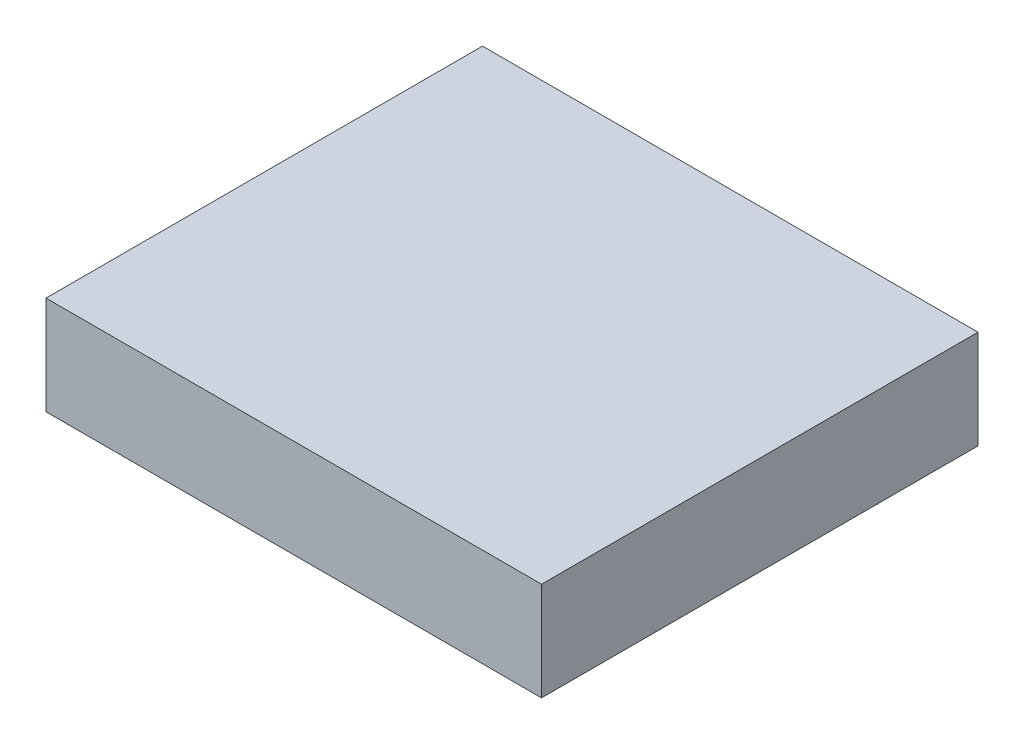
ISO-10303-21;
HEADER;
FILE_DESCRIPTION(('STEP AP214'),'2;1');
FILE_NAME('part.step','',(''),(''),'','','');
FILE_SCHEMA(('AUTOMOTIVE_DESIGN { 1 0 10303 214 1 1 1 1 }'));
ENDSEC;
DATA;
#1=APPLICATION_CONTEXT('core data for automotive mechanical design processes');
#2=APPLICATION_PROTOCOL_DEFINITION('international standard','automotive_design',2000,#1);
#3=PRODUCT_CONTEXT('',#1,'mechanical');
#4=PRODUCT('Part','Part','',(#3));
#5=PRODUCT_RELATED_PRODUCT_CATEGORY('part','',(#4));
#6=PRODUCT_DEFINITION_FORMATION('','',#4);
#7=PRODUCT_DEFINITION_CONTEXT('part definition',#1,'design');
#8=PRODUCT_DEFINITION('design','',#6,#7);
#9=PRODUCT_DEFINITION_SHAPE('','',#8);
#10=(LENGTH_UNIT() NAMED_UNIT(*) SI_UNIT(.MILLI.,.METRE.));
#11=(NAMED_UNIT(*) PLANE_ANGLE_UNIT() SI_UNIT($,.RADIAN.));
#12=(NAMED_UNIT(*) SI_UNIT($,.STERADIAN.) SOLID_ANGLE_UNIT());
#13=UNCERTAINTY_MEASURE_WITH_UNIT(LENGTH_MEASURE(1.E-05),#10,'distance_accuracy_value','');
#14=(GEOMETRIC_REPRESENTATION_CONTEXT(3) GLOBAL_UNCERTAINTY_ASSIGNED_CONTEXT((#13)) GLOBAL_UNIT_ASSIGNED_CONTEXT((#10,
#11,#12)) REPRESENTATION_CONTEXT('',''));
#15=CARTESIAN_POINT('',(0.,0.,0.));
#16=DIRECTION('',(0.,0.,1.));
#17=DIRECTION('',(1.,0.,0.));
#18=AXIS2_PLACEMENT_3D('',#15,#16,#17);
#19=CARTESIAN_POINT('',(0.,3.,0.));
#20=DIRECTION('',(1.,0.,0.));
#21=DIRECTION('',(0.,0.,-1.));
#22=AXIS2_PLACEMENT_3D('',#19,#20,#21);
#23=PLANE('',#22);
#24=DIRECTION('',(0.,0.,1.));
#25=VECTOR('',#24,1.);
#26=CARTESIAN_POINT('',(0.,0.,0.));
#27=LINE('',#26,#25);
#28=CARTESIAN_POINT('',(0.,0.,0.));
#29=VERTEX_POINT('',#28);
#30=CARTESIAN_POINT('',(0.,0.,13.3));
#31=VERTEX_POINT('',#30);
#32=EDGE_CURVE('E96',#29,#31,#27,.T.);
#33=ORIENTED_EDGE('',*,*,#32,.T.);
#34=DIRECTION('',(0.,-1.,0.));
#35=VECTOR('',#34,1.);
#36=CARTESIAN_POINT('',(0.,3.,13.3));
#37=LINE('',#36,#35);
#38=CARTESIAN_POINT('',(0.,3.,13.3));
#39=VERTEX_POINT('',#38);
#40=EDGE_CURVE('E11',#39,#31,#37,.T.);
#41=ORIENTED_EDGE('',*,*,#40,.F.);
#42=DIRECTION('',(0.,0.,1.));
#43=VECTOR('',#42,1.);
#44=CARTESIAN_POINT('',(0.,3.,0.));
#45=LINE('',#44,#43);
#46=CARTESIAN_POINT('',(0.,3.,0.));
#47=VERTEX_POINT('',#46);
#48=EDGE_CURVE('E84',#47,#39,#45,.T.);
#49=ORIENTED_EDGE('',*,*,#48,.F.);
#50=DIRECTION('',(0.,-1.,0.));
#51=VECTOR('',#50,1.);
#52=CARTESIAN_POINT('',(0.,3.,0.));
#53=LINE('',#52,#51);
#54=EDGE_CURVE('E92',#47,#29,#53,.T.);
#55=ORIENTED_EDGE('',*,*,#54,.T.);
#56=EDGE_LOOP('',(#33,#41,#49,#55));
#57=FACE_BOUND('',#56,.T.);
#58=ADVANCED_FACE('F33',(#57),#23,.F.);
#59=CARTESIAN_POINT('',(0.,3.,13.3));
#60=DIRECTION('',(0.,0.,-1.));
#61=DIRECTION('',(-1.,0.,0.));
#62=AXIS2_PLACEMENT_3D('',#59,#60,#61);
#63=PLANE('',#62);
#64=DIRECTION('',(1.,0.,0.));
#65=VECTOR('',#64,1.);
#66=CARTESIAN_POINT('',(0.,0.,13.3));
#67=LINE('',#66,#65);
#68=CARTESIAN_POINT('',(15.1,0.,13.3));
#69=VERTEX_POINT('',#68);
#70=EDGE_CURVE('E88',#31,#69,#67,.T.);
#71=ORIENTED_EDGE('',*,*,#70,.T.);
#72=DIRECTION('',(0.,-1.,0.));
#73=VECTOR('',#72,1.);
#74=CARTESIAN_POINT('',(15.1,3.,13.3));
#75=LINE('',#74,#73);
#76=CARTESIAN_POINT('',(15.1,3.,13.3));
#77=VERTEX_POINT('',#76);
#78=EDGE_CURVE('E41',#77,#69,#75,.T.);
#79=ORIENTED_EDGE('',*,*,#78,.F.);
#80=DIRECTION('',(1.,0.,0.));
#81=VECTOR('',#80,1.);
#82=CARTESIAN_POINT('',(0.,3.,13.3));
#83=LINE('',#82,#81);
#84=EDGE_CURVE('E79',#39,#77,#83,.T.);
#85=ORIENTED_EDGE('',*,*,#84,.F.);
#86=ORIENTED_EDGE('',*,*,#40,.T.);
#87=EDGE_LOOP('',(#71,#79,#85,#86));
#88=FACE_BOUND('',#87,.T.);
#89=ADVANCED_FACE('F87',(#88),#63,.F.);
#90=CARTESIAN_POINT('',(15.1,3.,0.));
#91=DIRECTION('',(-1.,0.,0.));
#92=DIRECTION('',(0.,0.,1.));
#93=AXIS2_PLACEMENT_3D('',#90,#91,#92);
#94=PLANE('',#93);
#95=DIRECTION('',(0.,0.,-1.));
#96=VECTOR('',#95,1.);
#97=CARTESIAN_POINT('',(15.1,0.,0.));
#98=LINE('',#97,#96);
#99=CARTESIAN_POINT('',(15.1,0.,0.));
#100=VERTEX_POINT('',#99);
#101=EDGE_CURVE('E66',#69,#100,#98,.T.);
#102=ORIENTED_EDGE('',*,*,#101,.T.);
#103=DIRECTION('',(0.,-1.,0.));
#104=VECTOR('',#103,1.);
#105=CARTESIAN_POINT('',(15.1,3.,0.));
#106=LINE('',#105,#104);
#107=CARTESIAN_POINT('',(15.1,3.,0.));
#108=VERTEX_POINT('',#107);
#109=EDGE_CURVE('E89',#108,#100,#106,.T.);
#110=ORIENTED_EDGE('',*,*,#109,.F.);
#111=DIRECTION('',(0.,0.,-1.));
#112=VECTOR('',#111,1.);
#113=CARTESIAN_POINT('',(15.1,3.,0.));
#114=LINE('',#113,#112);
#115=EDGE_CURVE('E82',#77,#108,#114,.T.);
#116=ORIENTED_EDGE('',*,*,#115,.F.);
#117=ORIENTED_EDGE('',*,*,#78,.T.);
#118=EDGE_LOOP('',(#102,#110,#116,#117));
#119=FACE_BOUND('',#118,.T.);
#120=ADVANCED_FACE('F90',(#119),#94,.F.);
#121=CARTESIAN_POINT('',(0.,3.,0.));
#122=DIRECTION('',(0.,0.,1.));
#123=DIRECTION('',(1.,0.,0.));
#124=AXIS2_PLACEMENT_3D('',#121,#122,#123);
#125=PLANE('',#124);
#126=DIRECTION('',(-1.,0.,0.));
#127=VECTOR('',#126,1.);
#128=CARTESIAN_POINT('',(0.,0.,0.));
#129=LINE('',#128,#127);
#130=EDGE_CURVE('E72',#100,#29,#129,.T.);
#131=ORIENTED_EDGE('',*,*,#130,.T.);
#132=ORIENTED_EDGE('',*,*,#54,.F.);
#133=DIRECTION('',(-1.,0.,0.));
#134=VECTOR('',#133,1.);
#135=CARTESIAN_POINT('',(0.,3.,0.));
#136=LINE('',#135,#134);
#137=EDGE_CURVE('E49',#108,#47,#136,.T.);
#138=ORIENTED_EDGE('',*,*,#137,.F.);
#139=ORIENTED_EDGE('',*,*,#109,.T.);
#140=EDGE_LOOP('',(#131,#132,#138,#139));
#141=FACE_BOUND('',#140,.T.);
#142=ADVANCED_FACE('F103',(#141),#125,.F.);
#143=CARTESIAN_POINT('',(0.,3.,0.));
#144=DIRECTION('',(0.,1.,0.));
#145=DIRECTION('',(0.,0.,1.));
#146=AXIS2_PLACEMENT_3D('',#143,#144,#145);
#147=PLANE('',#146);
#148=ORIENTED_EDGE('',*,*,#48,.T.);
#149=ORIENTED_EDGE('',*,*,#84,.T.);
#150=ORIENTED_EDGE('',*,*,#115,.T.);
#151=ORIENTED_EDGE('',*,*,#137,.T.);
#152=EDGE_LOOP('',(#148,#149,#150,#151));
#153=FACE_BOUND('',#152,.T.);
#154=ADVANCED_FACE('F80',(#153),#147,.T.);
#155=CARTESIAN_POINT('',(0.,0.,0.));
#156=DIRECTION('',(0.,1.,0.));
#157=DIRECTION('',(0.,0.,1.));
#158=AXIS2_PLACEMENT_3D('',#155,#156,#157);
#159=PLANE('',#158);
#160=ORIENTED_EDGE('',*,*,#32,.F.);
#161=ORIENTED_EDGE('',*,*,#130,.F.);
#162=ORIENTED_EDGE('',*,*,#101,.F.);
#163=ORIENTED_EDGE('',*,*,#70,.F.);
#164=EDGE_LOOP('',(#160,#161,#162,#163));
#165=FACE_BOUND('',#164,.T.);
#166=ADVANCED_FACE('F106',(#165),#159,.F.);
#167=CLOSED_SHELL('',(#58,#89,#120,#142,#154,#166));
#168=MANIFOLD_SOLID_BREP('B2',#167);
#169=ADVANCED_BREP_SHAPE_REPRESENTATION('',(#18,#168),#14);
#170=SHAPE_DEFINITION_REPRESENTATION(#9,#169);
ENDSEC;
END-ISO-10303-21;
